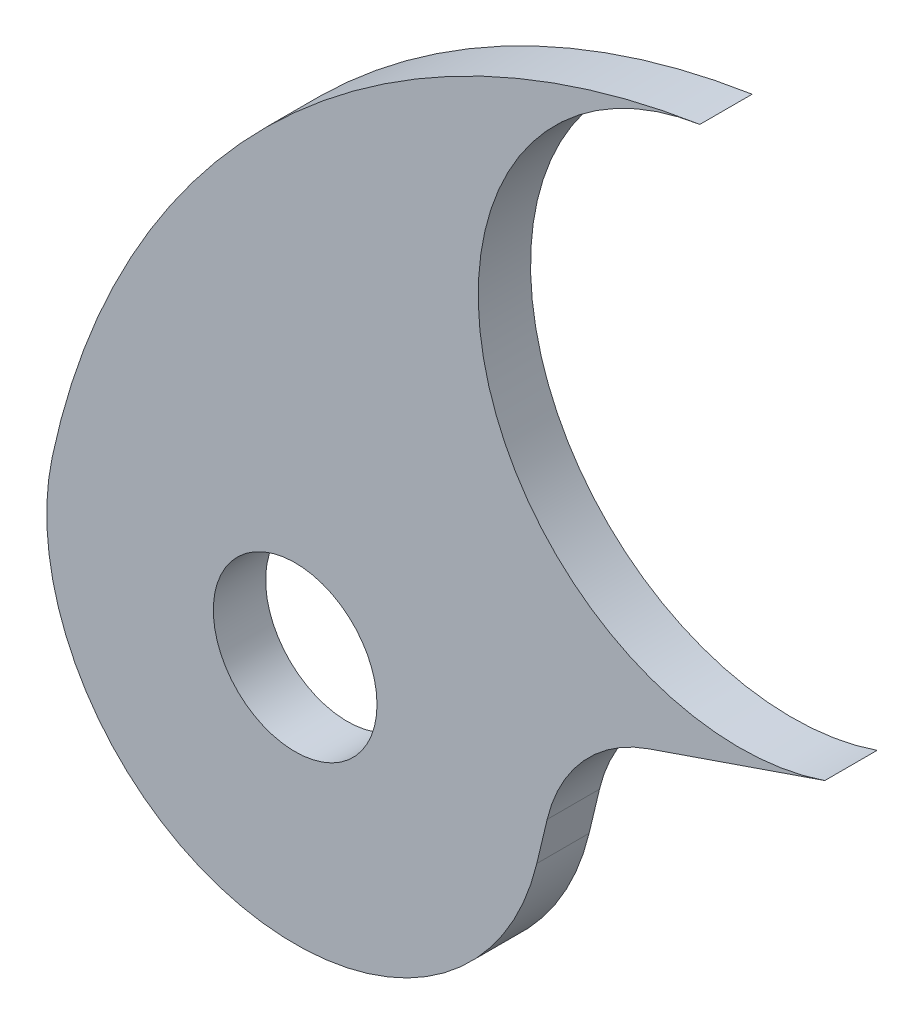
ISO-10303-21;
HEADER;
FILE_DESCRIPTION(('STEP AP214'),'2;1');
FILE_NAME('part.step','',(''),(''),'','','');
FILE_SCHEMA(('AUTOMOTIVE_DESIGN { 1 0 10303 214 1 1 1 1 }'));
ENDSEC;
DATA;
#1=APPLICATION_CONTEXT('core data for automotive mechanical design processes');
#2=APPLICATION_PROTOCOL_DEFINITION('international standard','automotive_design',2000,#1);
#3=PRODUCT_CONTEXT('',#1,'mechanical');
#4=PRODUCT('Part','Part','',(#3));
#5=PRODUCT_RELATED_PRODUCT_CATEGORY('part','',(#4));
#6=PRODUCT_DEFINITION_FORMATION('','',#4);
#7=PRODUCT_DEFINITION_CONTEXT('part definition',#1,'design');
#8=PRODUCT_DEFINITION('design','',#6,#7);
#9=PRODUCT_DEFINITION_SHAPE('','',#8);
#10=(LENGTH_UNIT() NAMED_UNIT(*) SI_UNIT(.MILLI.,.METRE.));
#11=(NAMED_UNIT(*) PLANE_ANGLE_UNIT() SI_UNIT($,.RADIAN.));
#12=(NAMED_UNIT(*) SI_UNIT($,.STERADIAN.) SOLID_ANGLE_UNIT());
#13=UNCERTAINTY_MEASURE_WITH_UNIT(LENGTH_MEASURE(1.E-05),#10,'distance_accuracy_value','');
#14=(GEOMETRIC_REPRESENTATION_CONTEXT(3) GLOBAL_UNCERTAINTY_ASSIGNED_CONTEXT((#13)) GLOBAL_UNIT_ASSIGNED_CONTEXT((#10,
#11,#12)) REPRESENTATION_CONTEXT('',''));
#15=CARTESIAN_POINT('',(0.,0.,0.));
#16=DIRECTION('',(0.,0.,1.));
#17=DIRECTION('',(1.,0.,0.));
#18=AXIS2_PLACEMENT_3D('',#15,#16,#17);
#19=CARTESIAN_POINT('',(-192.218217506696,139.7,120.1547));
#20=DIRECTION('',(0.,0.,1.));
#21=DIRECTION('',(1.,0.,0.));
#22=AXIS2_PLACEMENT_3D('',#19,#20,#21);
#23=PLANE('',#22);
#24=CARTESIAN_POINT('',(-192.218217506696,139.7,120.1547));
#25=DIRECTION('',(0.,0.,-1.));
#26=DIRECTION('',(1.,0.,0.));
#27=AXIS2_PLACEMENT_3D('',#24,#25,#26);
#28=CIRCLE('',#27,12.7);
#29=CARTESIAN_POINT('',(-188.087075805339,127.69068410594,120.1547));
#30=VERTEX_POINT('',#29);
#31=CARTESIAN_POINT('',(-194.15575587363,152.251332402445,120.1547));
#32=VERTEX_POINT('',#31);
#33=EDGE_CURVE('E130',#30,#32,#28,.T.);
#34=ORIENTED_EDGE('',*,*,#33,.T.);
#35=CARTESIAN_POINT('',(-188.343140772826,114.597335195111,120.1547));
#36=DIRECTION('',(0.,0.,1.));
#37=DIRECTION('',(1.,0.,0.));
#38=AXIS2_PLACEMENT_3D('',#35,#36,#37);
#39=CIRCLE('',#38,38.1);
#40=CARTESIAN_POINT('',(-225.60910672483,122.525625153485,120.1547));
#41=VERTEX_POINT('',#40);
#42=EDGE_CURVE('E88',#32,#41,#39,.T.);
#43=ORIENTED_EDGE('',*,*,#42,.T.);
#44=CARTESIAN_POINT('',(-213.808217506696,120.015,120.1547));
#45=DIRECTION('',(0.,0.,1.));
#46=DIRECTION('',(1.,0.,0.));
#47=AXIS2_PLACEMENT_3D('',#44,#45,#46);
#48=CIRCLE('',#47,12.065);
#49=CARTESIAN_POINT('',(-202.074240019488,117.208222964021,120.1547));
#50=VERTEX_POINT('',#49);
#51=EDGE_CURVE('E101',#41,#50,#48,.T.);
#52=ORIENTED_EDGE('',*,*,#51,.T.);
#53=DIRECTION('',(0.232637964026493,0.972563405487585,0.));
#54=VECTOR('',#53,1.);
#55=CARTESIAN_POINT('',(-202.074240019488,117.208222964021,120.1547));
#56=LINE('',#55,#54);
#57=CARTESIAN_POINT('',(-201.569956850912,119.316422964021,120.1547));
#58=VERTEX_POINT('',#57);
#59=EDGE_CURVE('E95',#50,#58,#56,.T.);
#60=ORIENTED_EDGE('',*,*,#59,.T.);
#61=CARTESIAN_POINT('',(-194.159023701096,117.543721678139,120.1547));
#62=DIRECTION('',(0.,0.,-1.));
#63=DIRECTION('',(1.,0.,0.));
#64=AXIS2_PLACEMENT_3D('',#61,#62,#63);
#65=CIRCLE('',#64,7.62);
#66=CARTESIAN_POINT('',(-196.63770872191,124.749311214575,120.1547));
#67=VERTEX_POINT('',#66);
#68=EDGE_CURVE('E99',#58,#67,#65,.T.);
#69=ORIENTED_EDGE('',*,*,#68,.T.);
#70=DIRECTION('',(0.945615424729112,0.325286748138288,0.));
#71=VECTOR('',#70,1.);
#72=CARTESIAN_POINT('',(-196.63770872191,124.749311214575,120.1547));
#73=LINE('',#72,#71);
#74=EDGE_CURVE('E51',#67,#30,#73,.T.);
#75=ORIENTED_EDGE('',*,*,#74,.T.);
#76=EDGE_LOOP('',(#34,#43,#52,#60,#69,#75));
#77=FACE_BOUND('',#76,.T.);
#78=CARTESIAN_POINT('',(-213.808217506696,120.015,120.1547));
#79=DIRECTION('',(0.,0.,1.));
#80=DIRECTION('',(1.,0.,0.));
#81=AXIS2_PLACEMENT_3D('',#78,#79,#80);
#82=CIRCLE('',#81,3.9751);
#83=CARTESIAN_POINT('',(-209.833117506696,120.015,120.1547));
#84=VERTEX_POINT('',#83);
#85=EDGE_CURVE('E123',#84,#84,#82,.T.);
#86=ORIENTED_EDGE('',*,*,#85,.F.);
#87=EDGE_LOOP('',(#86));
#88=FACE_BOUND('',#87,.T.);
#89=ADVANCED_FACE('F34',(#77,#88),#23,.T.);
#90=CARTESIAN_POINT('',(-192.218217506696,139.7,117.6147));
#91=DIRECTION('',(0.,0.,1.));
#92=DIRECTION('',(1.,0.,0.));
#93=AXIS2_PLACEMENT_3D('',#90,#91,#92);
#94=PLANE('',#93);
#95=CARTESIAN_POINT('',(-192.218217506696,139.7,117.6147));
#96=DIRECTION('',(0.,0.,-1.));
#97=DIRECTION('',(1.,0.,0.));
#98=AXIS2_PLACEMENT_3D('',#95,#96,#97);
#99=CIRCLE('',#98,12.7);
#100=CARTESIAN_POINT('',(-188.087075805339,127.69068410594,117.6147));
#101=VERTEX_POINT('',#100);
#102=CARTESIAN_POINT('',(-194.15575587363,152.251332402445,117.6147));
#103=VERTEX_POINT('',#102);
#104=EDGE_CURVE('E119',#101,#103,#99,.T.);
#105=ORIENTED_EDGE('',*,*,#104,.F.);
#106=DIRECTION('',(0.945615424729112,0.325286748138288,0.));
#107=VECTOR('',#106,1.);
#108=CARTESIAN_POINT('',(-196.63770872191,124.749311214575,117.6147));
#109=LINE('',#108,#107);
#110=CARTESIAN_POINT('',(-196.63770872191,124.749311214575,117.6147));
#111=VERTEX_POINT('',#110);
#112=EDGE_CURVE('E80',#111,#101,#109,.T.);
#113=ORIENTED_EDGE('',*,*,#112,.F.);
#114=CARTESIAN_POINT('',(-194.159023701096,117.543721678139,117.6147));
#115=DIRECTION('',(0.,0.,-1.));
#116=DIRECTION('',(1.,0.,0.));
#117=AXIS2_PLACEMENT_3D('',#114,#115,#116);
#118=CIRCLE('',#117,7.62);
#119=CARTESIAN_POINT('',(-201.569956850912,119.316422964021,117.6147));
#120=VERTEX_POINT('',#119);
#121=EDGE_CURVE('E74',#120,#111,#118,.T.);
#122=ORIENTED_EDGE('',*,*,#121,.F.);
#123=DIRECTION('',(0.232637964026493,0.972563405487585,0.));
#124=VECTOR('',#123,1.);
#125=CARTESIAN_POINT('',(-202.074240019488,117.208222964021,117.6147));
#126=LINE('',#125,#124);
#127=CARTESIAN_POINT('',(-202.074240019488,117.208222964021,117.6147));
#128=VERTEX_POINT('',#127);
#129=EDGE_CURVE('E109',#128,#120,#126,.T.);
#130=ORIENTED_EDGE('',*,*,#129,.F.);
#131=CARTESIAN_POINT('',(-213.808217506696,120.015,117.6147));
#132=DIRECTION('',(0.,0.,1.));
#133=DIRECTION('',(1.,0.,0.));
#134=AXIS2_PLACEMENT_3D('',#131,#132,#133);
#135=CIRCLE('',#134,12.065);
#136=CARTESIAN_POINT('',(-225.60910672483,122.525625153485,117.6147));
#137=VERTEX_POINT('',#136);
#138=EDGE_CURVE('E125',#137,#128,#135,.T.);
#139=ORIENTED_EDGE('',*,*,#138,.F.);
#140=CARTESIAN_POINT('',(-188.343140772826,114.597335195111,117.6147));
#141=DIRECTION('',(0.,0.,1.));
#142=DIRECTION('',(1.,0.,0.));
#143=AXIS2_PLACEMENT_3D('',#140,#141,#142);
#144=CIRCLE('',#143,38.1);
#145=EDGE_CURVE('E122',#103,#137,#144,.T.);
#146=ORIENTED_EDGE('',*,*,#145,.F.);
#147=EDGE_LOOP('',(#105,#113,#122,#130,#139,#146));
#148=FACE_BOUND('',#147,.T.);
#149=CARTESIAN_POINT('',(-213.808217506696,120.015,117.6147));
#150=DIRECTION('',(0.,0.,1.));
#151=DIRECTION('',(1.,0.,0.));
#152=AXIS2_PLACEMENT_3D('',#149,#150,#151);
#153=CIRCLE('',#152,3.9751);
#154=CARTESIAN_POINT('',(-209.833117506696,120.015,117.6147));
#155=VERTEX_POINT('',#154);
#156=EDGE_CURVE('E223',#155,#155,#153,.T.);
#157=ORIENTED_EDGE('',*,*,#156,.T.);
#158=EDGE_LOOP('',(#157));
#159=FACE_BOUND('',#158,.T.);
#160=ADVANCED_FACE('F139',(#148,#159),#94,.F.);
#161=CARTESIAN_POINT('',(-192.218217506696,139.7,120.1547));
#162=DIRECTION('',(0.,0.,-1.));
#163=DIRECTION('',(-1.,0.,0.));
#164=AXIS2_PLACEMENT_3D('',#161,#162,#163);
#165=CYLINDRICAL_SURFACE('',#164,12.7);
#166=ORIENTED_EDGE('',*,*,#104,.T.);
#167=DIRECTION('',(0.,0.,-1.));
#168=VECTOR('',#167,1.);
#169=CARTESIAN_POINT('',(-194.15575587363,152.251332402445,120.1547));
#170=LINE('',#169,#168);
#171=EDGE_CURVE('E11',#32,#103,#170,.T.);
#172=ORIENTED_EDGE('',*,*,#171,.F.);
#173=ORIENTED_EDGE('',*,*,#33,.F.);
#174=DIRECTION('',(0.,0.,-1.));
#175=VECTOR('',#174,1.);
#176=CARTESIAN_POINT('',(-188.087075805339,127.69068410594,120.1547));
#177=LINE('',#176,#175);
#178=EDGE_CURVE('E115',#30,#101,#177,.T.);
#179=ORIENTED_EDGE('',*,*,#178,.T.);
#180=EDGE_LOOP('',(#166,#172,#173,#179));
#181=FACE_BOUND('',#180,.T.);
#182=ADVANCED_FACE('F36',(#181),#165,.F.);
#183=CARTESIAN_POINT('',(-188.343140772826,114.597335195111,120.1547));
#184=DIRECTION('',(0.,0.,-1.));
#185=DIRECTION('',(-1.,0.,0.));
#186=AXIS2_PLACEMENT_3D('',#183,#184,#185);
#187=CYLINDRICAL_SURFACE('',#186,38.1);
#188=ORIENTED_EDGE('',*,*,#145,.T.);
#189=DIRECTION('',(0.,0.,-1.));
#190=VECTOR('',#189,1.);
#191=CARTESIAN_POINT('',(-225.60910672483,122.525625153485,120.1547));
#192=LINE('',#191,#190);
#193=EDGE_CURVE('E43',#41,#137,#192,.T.);
#194=ORIENTED_EDGE('',*,*,#193,.F.);
#195=ORIENTED_EDGE('',*,*,#42,.F.);
#196=ORIENTED_EDGE('',*,*,#171,.T.);
#197=EDGE_LOOP('',(#188,#194,#195,#196));
#198=FACE_BOUND('',#197,.T.);
#199=ADVANCED_FACE('F164',(#198),#187,.T.);
#200=CARTESIAN_POINT('',(-213.808217506696,120.015,120.1547));
#201=DIRECTION('',(0.,0.,-1.));
#202=DIRECTION('',(-1.,0.,0.));
#203=AXIS2_PLACEMENT_3D('',#200,#201,#202);
#204=CYLINDRICAL_SURFACE('',#203,12.065);
#205=ORIENTED_EDGE('',*,*,#138,.T.);
#206=DIRECTION('',(0.,0.,-1.));
#207=VECTOR('',#206,1.);
#208=CARTESIAN_POINT('',(-202.074240019488,117.208222964021,120.1547));
#209=LINE('',#208,#207);
#210=EDGE_CURVE('E110',#50,#128,#209,.T.);
#211=ORIENTED_EDGE('',*,*,#210,.F.);
#212=ORIENTED_EDGE('',*,*,#51,.F.);
#213=ORIENTED_EDGE('',*,*,#193,.T.);
#214=EDGE_LOOP('',(#205,#211,#212,#213));
#215=FACE_BOUND('',#214,.T.);
#216=ADVANCED_FACE('F136',(#215),#204,.T.);
#217=CARTESIAN_POINT('',(-202.074240019488,117.208222964021,120.1547));
#218=DIRECTION('',(-0.972563405487585,0.232637964026493,0.));
#219=DIRECTION('',(-0.232637964026493,-0.972563405487585,0.));
#220=AXIS2_PLACEMENT_3D('',#217,#218,#219);
#221=PLANE('',#220);
#222=ORIENTED_EDGE('',*,*,#129,.T.);
#223=DIRECTION('',(0.,0.,-1.));
#224=VECTOR('',#223,1.);
#225=CARTESIAN_POINT('',(-201.569956850912,119.316422964021,120.1547));
#226=LINE('',#225,#224);
#227=EDGE_CURVE('E106',#58,#120,#226,.T.);
#228=ORIENTED_EDGE('',*,*,#227,.F.);
#229=ORIENTED_EDGE('',*,*,#59,.F.);
#230=ORIENTED_EDGE('',*,*,#210,.T.);
#231=EDGE_LOOP('',(#222,#228,#229,#230));
#232=FACE_BOUND('',#231,.T.);
#233=ADVANCED_FACE('F107',(#232),#221,.F.);
#234=CARTESIAN_POINT('',(-194.159023701096,117.543721678139,120.1547));
#235=DIRECTION('',(0.,0.,-1.));
#236=DIRECTION('',(-1.,0.,0.));
#237=AXIS2_PLACEMENT_3D('',#234,#235,#236);
#238=CYLINDRICAL_SURFACE('',#237,7.62);
#239=ORIENTED_EDGE('',*,*,#121,.T.);
#240=DIRECTION('',(0.,0.,-1.));
#241=VECTOR('',#240,1.);
#242=CARTESIAN_POINT('',(-196.63770872191,124.749311214575,120.1547));
#243=LINE('',#242,#241);
#244=EDGE_CURVE('E111',#67,#111,#243,.T.);
#245=ORIENTED_EDGE('',*,*,#244,.F.);
#246=ORIENTED_EDGE('',*,*,#68,.F.);
#247=ORIENTED_EDGE('',*,*,#227,.T.);
#248=EDGE_LOOP('',(#239,#245,#246,#247));
#249=FACE_BOUND('',#248,.T.);
#250=ADVANCED_FACE('F113',(#249),#238,.F.);
#251=CARTESIAN_POINT('',(-196.63770872191,124.749311214575,120.1547));
#252=DIRECTION('',(-0.325286748138288,0.945615424729112,0.));
#253=DIRECTION('',(-0.945615424729112,-0.325286748138288,0.));
#254=AXIS2_PLACEMENT_3D('',#251,#252,#253);
#255=PLANE('',#254);
#256=ORIENTED_EDGE('',*,*,#112,.T.);
#257=ORIENTED_EDGE('',*,*,#178,.F.);
#258=ORIENTED_EDGE('',*,*,#74,.F.);
#259=ORIENTED_EDGE('',*,*,#244,.T.);
#260=EDGE_LOOP('',(#256,#257,#258,#259));
#261=FACE_BOUND('',#260,.T.);
#262=ADVANCED_FACE('F144',(#261),#255,.F.);
#263=CARTESIAN_POINT('',(-213.808217506696,120.015,120.1547));
#264=DIRECTION('',(0.,0.,-1.));
#265=DIRECTION('',(-1.,0.,0.));
#266=AXIS2_PLACEMENT_3D('',#263,#264,#265);
#267=CYLINDRICAL_SURFACE('',#266,3.9751);
#268=ORIENTED_EDGE('',*,*,#85,.T.);
#269=EDGE_LOOP('',(#268));
#270=FACE_BOUND('',#269,.T.);
#271=ORIENTED_EDGE('',*,*,#156,.F.);
#272=EDGE_LOOP('',(#271));
#273=FACE_BOUND('',#272,.T.);
#274=ADVANCED_FACE('F146',(#270,#273),#267,.F.);
#275=CLOSED_SHELL('',(#89,#160,#182,#199,#216,#233,#250,#262,#274));
#276=MANIFOLD_SOLID_BREP('B2',#275);
#277=ADVANCED_BREP_SHAPE_REPRESENTATION('',(#18,#276),#14);
#278=SHAPE_DEFINITION_REPRESENTATION(#9,#277);
ENDSEC;
END-ISO-10303-21;
